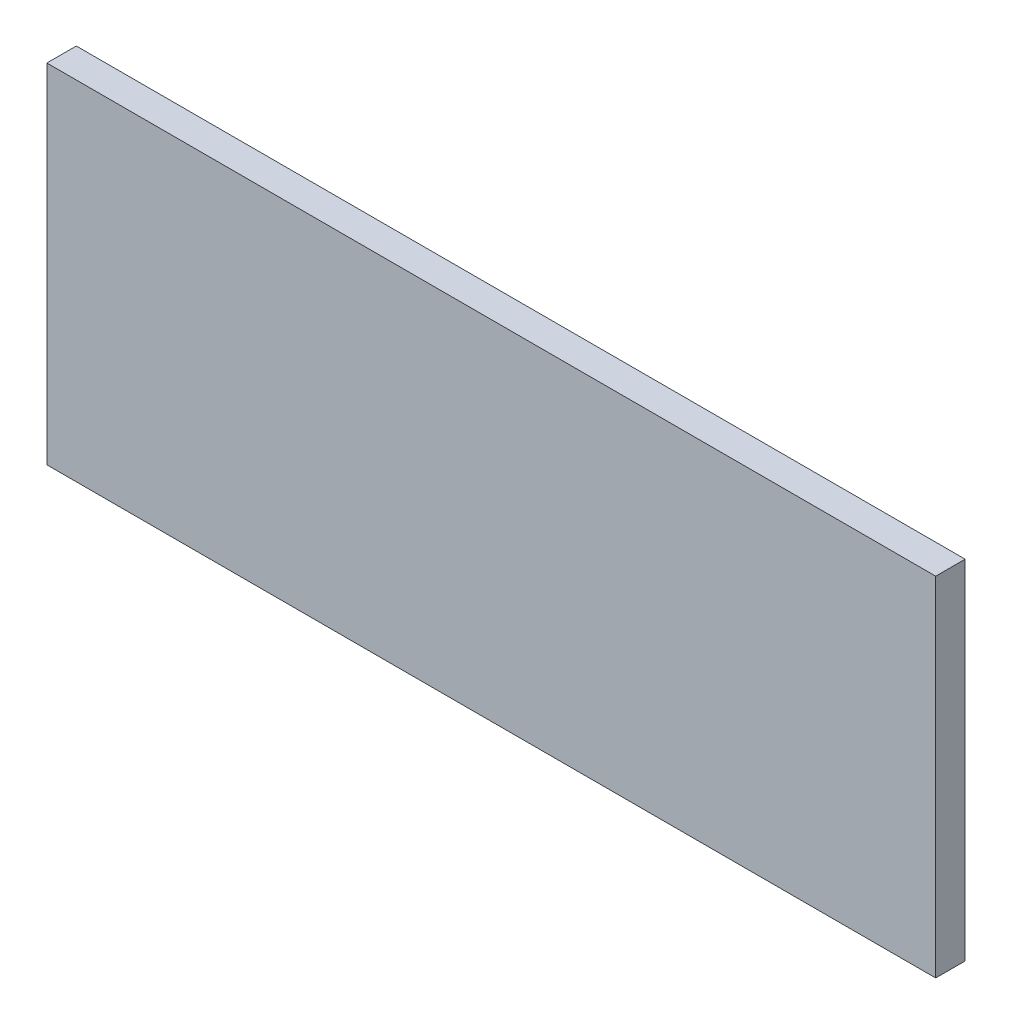
ISO-10303-21;
HEADER;
FILE_DESCRIPTION(('STEP AP214'),'2;1');
FILE_NAME('part.step','',(''),(''),'','','');
FILE_SCHEMA(('AUTOMOTIVE_DESIGN { 1 0 10303 214 1 1 1 1 }'));
ENDSEC;
DATA;
#1=APPLICATION_CONTEXT('core data for automotive mechanical design processes');
#2=APPLICATION_PROTOCOL_DEFINITION('international standard','automotive_design',2000,#1);
#3=PRODUCT_CONTEXT('',#1,'mechanical');
#4=PRODUCT('Part','Part','',(#3));
#5=PRODUCT_RELATED_PRODUCT_CATEGORY('part','',(#4));
#6=PRODUCT_DEFINITION_FORMATION('','',#4);
#7=PRODUCT_DEFINITION_CONTEXT('part definition',#1,'design');
#8=PRODUCT_DEFINITION('design','',#6,#7);
#9=PRODUCT_DEFINITION_SHAPE('','',#8);
#10=(LENGTH_UNIT() NAMED_UNIT(*) SI_UNIT(.MILLI.,.METRE.));
#11=(NAMED_UNIT(*) PLANE_ANGLE_UNIT() SI_UNIT($,.RADIAN.));
#12=(NAMED_UNIT(*) SI_UNIT($,.STERADIAN.) SOLID_ANGLE_UNIT());
#13=UNCERTAINTY_MEASURE_WITH_UNIT(LENGTH_MEASURE(1.E-05),#10,'distance_accuracy_value','');
#14=(GEOMETRIC_REPRESENTATION_CONTEXT(3) GLOBAL_UNCERTAINTY_ASSIGNED_CONTEXT((#13)) GLOBAL_UNIT_ASSIGNED_CONTEXT((#10,
#11,#12)) REPRESENTATION_CONTEXT('',''));
#15=CARTESIAN_POINT('',(0.,0.,0.));
#16=DIRECTION('',(0.,0.,1.));
#17=DIRECTION('',(1.,0.,0.));
#18=AXIS2_PLACEMENT_3D('',#15,#16,#17);
#19=CARTESIAN_POINT('',(3093.64275716415,1129.80169471235,0.762));
#20=DIRECTION('',(-1.,0.,0.));
#21=DIRECTION('',(0.,0.,1.));
#22=AXIS2_PLACEMENT_3D('',#19,#20,#21);
#23=PLANE('',#22);
#24=DIRECTION('',(0.,1.,0.));
#25=VECTOR('',#24,1.);
#26=CARTESIAN_POINT('',(3093.64275716415,1129.80169471235,0.));
#27=LINE('',#26,#25);
#28=CARTESIAN_POINT('',(3093.64275716415,1129.80169471235,0.));
#29=VERTEX_POINT('',#28);
#30=CARTESIAN_POINT('',(3093.64275716415,1138.80969471235,0.));
#31=VERTEX_POINT('',#30);
#32=EDGE_CURVE('E95',#29,#31,#27,.T.);
#33=ORIENTED_EDGE('',*,*,#32,.T.);
#34=DIRECTION('',(0.,0.,-1.));
#35=VECTOR('',#34,1.);
#36=CARTESIAN_POINT('',(3093.64275716415,1138.80969471235,0.762));
#37=LINE('',#36,#35);
#38=CARTESIAN_POINT('',(3093.64275716415,1138.80969471235,0.762));
#39=VERTEX_POINT('',#38);
#40=EDGE_CURVE('E11',#39,#31,#37,.T.);
#41=ORIENTED_EDGE('',*,*,#40,.F.);
#42=DIRECTION('',(0.,1.,0.));
#43=VECTOR('',#42,1.);
#44=CARTESIAN_POINT('',(3093.64275716415,1129.80169471235,0.762));
#45=LINE('',#44,#43);
#46=CARTESIAN_POINT('',(3093.64275716415,1129.80169471235,0.762));
#47=VERTEX_POINT('',#46);
#48=EDGE_CURVE('E83',#47,#39,#45,.T.);
#49=ORIENTED_EDGE('',*,*,#48,.F.);
#50=DIRECTION('',(0.,0.,-1.));
#51=VECTOR('',#50,1.);
#52=CARTESIAN_POINT('',(3093.64275716415,1129.80169471235,0.762));
#53=LINE('',#52,#51);
#54=EDGE_CURVE('E91',#47,#29,#53,.T.);
#55=ORIENTED_EDGE('',*,*,#54,.T.);
#56=EDGE_LOOP('',(#33,#41,#49,#55));
#57=FACE_BOUND('',#56,.T.);
#58=ADVANCED_FACE('F32',(#57),#23,.F.);
#59=CARTESIAN_POINT('',(3093.64275716415,1138.80969471235,0.762));
#60=DIRECTION('',(0.,-1.,0.));
#61=DIRECTION('',(0.,0.,-1.));
#62=AXIS2_PLACEMENT_3D('',#59,#60,#61);
#63=PLANE('',#62);
#64=DIRECTION('',(-1.,0.,0.));
#65=VECTOR('',#64,1.);
#66=CARTESIAN_POINT('',(3093.64275716415,1138.80969471235,0.));
#67=LINE('',#66,#65);
#68=CARTESIAN_POINT('',(3070.63475716415,1138.80969471235,0.));
#69=VERTEX_POINT('',#68);
#70=EDGE_CURVE('E87',#31,#69,#67,.T.);
#71=ORIENTED_EDGE('',*,*,#70,.T.);
#72=DIRECTION('',(0.,0.,-1.));
#73=VECTOR('',#72,1.);
#74=CARTESIAN_POINT('',(3070.63475716415,1138.80969471235,0.762));
#75=LINE('',#74,#73);
#76=CARTESIAN_POINT('',(3070.63475716415,1138.80969471235,0.762));
#77=VERTEX_POINT('',#76);
#78=EDGE_CURVE('E40',#77,#69,#75,.T.);
#79=ORIENTED_EDGE('',*,*,#78,.F.);
#80=DIRECTION('',(-1.,0.,0.));
#81=VECTOR('',#80,1.);
#82=CARTESIAN_POINT('',(3093.64275716415,1138.80969471235,0.762));
#83=LINE('',#82,#81);
#84=EDGE_CURVE('E78',#39,#77,#83,.T.);
#85=ORIENTED_EDGE('',*,*,#84,.F.);
#86=ORIENTED_EDGE('',*,*,#40,.T.);
#87=EDGE_LOOP('',(#71,#79,#85,#86));
#88=FACE_BOUND('',#87,.T.);
#89=ADVANCED_FACE('F86',(#88),#63,.F.);
#90=CARTESIAN_POINT('',(3070.63475716415,1138.80969471235,0.762));
#91=DIRECTION('',(1.,0.,0.));
#92=DIRECTION('',(0.,0.,-1.));
#93=AXIS2_PLACEMENT_3D('',#90,#91,#92);
#94=PLANE('',#93);
#95=DIRECTION('',(0.,-1.,0.));
#96=VECTOR('',#95,1.);
#97=CARTESIAN_POINT('',(3070.63475716415,1138.80969471235,0.));
#98=LINE('',#97,#96);
#99=CARTESIAN_POINT('',(3070.63475716415,1129.80169471235,0.));
#100=VERTEX_POINT('',#99);
#101=EDGE_CURVE('E65',#69,#100,#98,.T.);
#102=ORIENTED_EDGE('',*,*,#101,.T.);
#103=DIRECTION('',(0.,0.,-1.));
#104=VECTOR('',#103,1.);
#105=CARTESIAN_POINT('',(3070.63475716415,1129.80169471235,0.762));
#106=LINE('',#105,#104);
#107=CARTESIAN_POINT('',(3070.63475716415,1129.80169471235,0.762));
#108=VERTEX_POINT('',#107);
#109=EDGE_CURVE('E88',#108,#100,#106,.T.);
#110=ORIENTED_EDGE('',*,*,#109,.F.);
#111=DIRECTION('',(0.,-1.,0.));
#112=VECTOR('',#111,1.);
#113=CARTESIAN_POINT('',(3070.63475716415,1138.80969471235,0.762));
#114=LINE('',#113,#112);
#115=EDGE_CURVE('E81',#77,#108,#114,.T.);
#116=ORIENTED_EDGE('',*,*,#115,.F.);
#117=ORIENTED_EDGE('',*,*,#78,.T.);
#118=EDGE_LOOP('',(#102,#110,#116,#117));
#119=FACE_BOUND('',#118,.T.);
#120=ADVANCED_FACE('F89',(#119),#94,.F.);
#121=CARTESIAN_POINT('',(3070.63475716415,1129.80169471235,0.762));
#122=DIRECTION('',(0.,1.,0.));
#123=DIRECTION('',(0.,0.,1.));
#124=AXIS2_PLACEMENT_3D('',#121,#122,#123);
#125=PLANE('',#124);
#126=DIRECTION('',(1.,0.,0.));
#127=VECTOR('',#126,1.);
#128=CARTESIAN_POINT('',(3070.63475716415,1129.80169471235,0.));
#129=LINE('',#128,#127);
#130=EDGE_CURVE('E71',#100,#29,#129,.T.);
#131=ORIENTED_EDGE('',*,*,#130,.T.);
#132=ORIENTED_EDGE('',*,*,#54,.F.);
#133=DIRECTION('',(1.,0.,0.));
#134=VECTOR('',#133,1.);
#135=CARTESIAN_POINT('',(3070.63475716415,1129.80169471235,0.762));
#136=LINE('',#135,#134);
#137=EDGE_CURVE('E48',#108,#47,#136,.T.);
#138=ORIENTED_EDGE('',*,*,#137,.F.);
#139=ORIENTED_EDGE('',*,*,#109,.T.);
#140=EDGE_LOOP('',(#131,#132,#138,#139));
#141=FACE_BOUND('',#140,.T.);
#142=ADVANCED_FACE('F102',(#141),#125,.F.);
#143=CARTESIAN_POINT('',(0.,0.,0.762));
#144=DIRECTION('',(0.,0.,1.));
#145=DIRECTION('',(1.,0.,0.));
#146=AXIS2_PLACEMENT_3D('',#143,#144,#145);
#147=PLANE('',#146);
#148=ORIENTED_EDGE('',*,*,#48,.T.);
#149=ORIENTED_EDGE('',*,*,#84,.T.);
#150=ORIENTED_EDGE('',*,*,#115,.T.);
#151=ORIENTED_EDGE('',*,*,#137,.T.);
#152=EDGE_LOOP('',(#148,#149,#150,#151));
#153=FACE_BOUND('',#152,.T.);
#154=ADVANCED_FACE('F79',(#153),#147,.T.);
#155=CARTESIAN_POINT('',(0.,0.,0.));
#156=DIRECTION('',(0.,0.,1.));
#157=DIRECTION('',(1.,0.,0.));
#158=AXIS2_PLACEMENT_3D('',#155,#156,#157);
#159=PLANE('',#158);
#160=ORIENTED_EDGE('',*,*,#32,.F.);
#161=ORIENTED_EDGE('',*,*,#130,.F.);
#162=ORIENTED_EDGE('',*,*,#101,.F.);
#163=ORIENTED_EDGE('',*,*,#70,.F.);
#164=EDGE_LOOP('',(#160,#161,#162,#163));
#165=FACE_BOUND('',#164,.T.);
#166=ADVANCED_FACE('F105',(#165),#159,.F.);
#167=CLOSED_SHELL('',(#58,#89,#120,#142,#154,#166));
#168=MANIFOLD_SOLID_BREP('B2',#167);
#169=ADVANCED_BREP_SHAPE_REPRESENTATION('',(#18,#168),#14);
#170=SHAPE_DEFINITION_REPRESENTATION(#9,#169);
ENDSEC;
END-ISO-10303-21;
